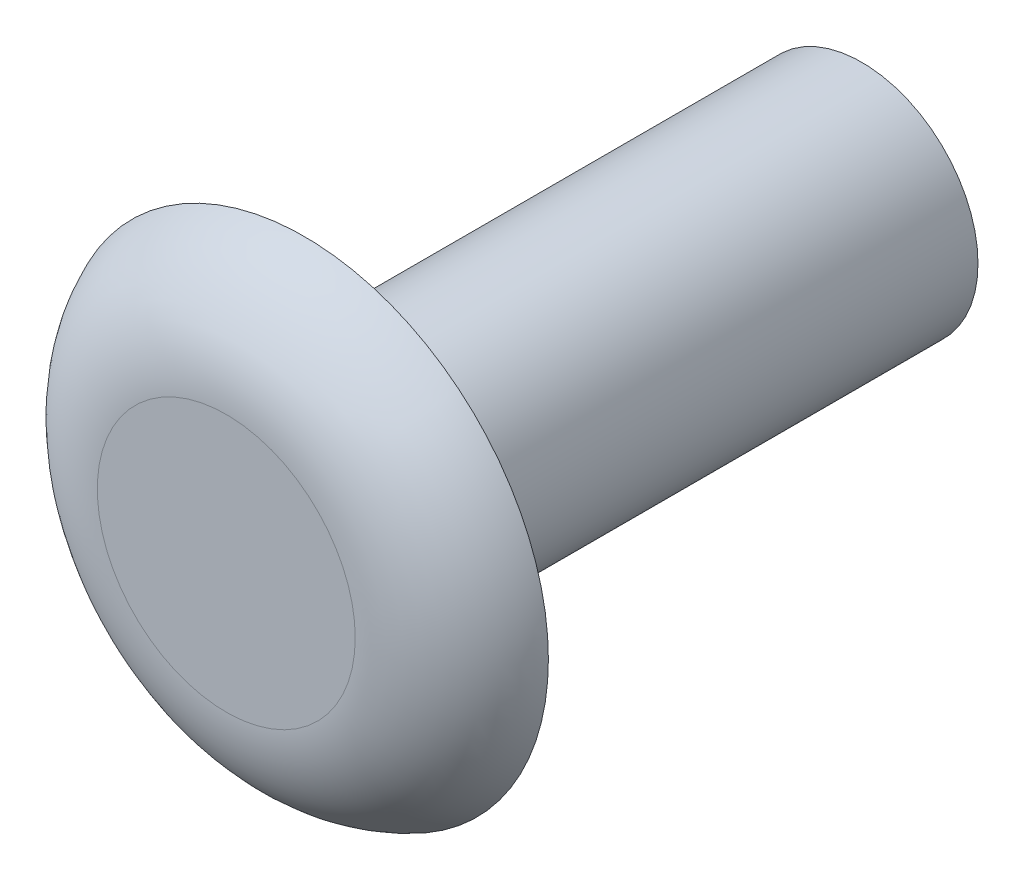
ISO-10303-21;
HEADER;
FILE_DESCRIPTION(('STEP AP214'),'2;1');
FILE_NAME('part.step','',(''),(''),'','','');
FILE_SCHEMA(('AUTOMOTIVE_DESIGN { 1 0 10303 214 1 1 1 1 }'));
ENDSEC;
DATA;
#1=APPLICATION_CONTEXT('core data for automotive mechanical design processes');
#2=APPLICATION_PROTOCOL_DEFINITION('international standard','automotive_design',2000,#1);
#3=PRODUCT_CONTEXT('',#1,'mechanical');
#4=PRODUCT('Part','Part','',(#3));
#5=PRODUCT_RELATED_PRODUCT_CATEGORY('part','',(#4));
#6=PRODUCT_DEFINITION_FORMATION('','',#4);
#7=PRODUCT_DEFINITION_CONTEXT('part definition',#1,'design');
#8=PRODUCT_DEFINITION('design','',#6,#7);
#9=PRODUCT_DEFINITION_SHAPE('','',#8);
#10=(LENGTH_UNIT() NAMED_UNIT(*) SI_UNIT(.MILLI.,.METRE.));
#11=(NAMED_UNIT(*) PLANE_ANGLE_UNIT() SI_UNIT($,.RADIAN.));
#12=(NAMED_UNIT(*) SI_UNIT($,.STERADIAN.) SOLID_ANGLE_UNIT());
#13=UNCERTAINTY_MEASURE_WITH_UNIT(LENGTH_MEASURE(1.E-05),#10,'distance_accuracy_value','');
#14=(GEOMETRIC_REPRESENTATION_CONTEXT(3) GLOBAL_UNCERTAINTY_ASSIGNED_CONTEXT((#13)) GLOBAL_UNIT_ASSIGNED_CONTEXT((#10,
#11,#12)) REPRESENTATION_CONTEXT('',''));
#15=CARTESIAN_POINT('',(0.,0.,0.));
#16=DIRECTION('',(0.,0.,1.));
#17=DIRECTION('',(1.,0.,0.));
#18=AXIS2_PLACEMENT_3D('',#15,#16,#17);
#19=CARTESIAN_POINT('',(0.,0.,1.6002));
#20=DIRECTION('',(0.,0.,1.));
#21=DIRECTION('',(1.,0.,0.));
#22=AXIS2_PLACEMENT_3D('',#19,#20,#21);
#23=PLANE('',#22);
#24=CARTESIAN_POINT('',(0.,0.,1.6002));
#25=DIRECTION('',(0.,0.,1.));
#26=DIRECTION('',(1.,0.,0.));
#27=AXIS2_PLACEMENT_3D('',#24,#25,#26);
#28=CIRCLE('',#27,2.64405934475841);
#29=CARTESIAN_POINT('',(2.64405934475841,0.,1.6002));
#30=VERTEX_POINT('',#29);
#31=EDGE_CURVE('E10',#30,#30,#28,.T.);
#32=ORIENTED_EDGE('',*,*,#31,.T.);
#33=EDGE_LOOP('',(#32));
#34=FACE_BOUND('',#33,.T.);
#35=ADVANCED_FACE('F34',(#34),#23,.T.);
#36=CARTESIAN_POINT('',(0.,0.,0.));
#37=DIRECTION('',(0.,0.,1.));
#38=DIRECTION('',(1.,0.,0.));
#39=AXIS2_PLACEMENT_3D('',#36,#37,#38);
#40=PLANE('',#39);
#41=CARTESIAN_POINT('',(0.,0.,0.));
#42=DIRECTION('',(0.,0.,1.));
#43=DIRECTION('',(1.,0.,0.));
#44=AXIS2_PLACEMENT_3D('',#41,#42,#43);
#45=CIRCLE('',#44,2.38125);
#46=CARTESIAN_POINT('',(2.38125,0.,0.));
#47=VERTEX_POINT('',#46);
#48=EDGE_CURVE('E49',#47,#47,#45,.T.);
#49=ORIENTED_EDGE('',*,*,#48,.T.);
#50=EDGE_LOOP('',(#49));
#51=FACE_BOUND('',#50,.T.);
#52=CARTESIAN_POINT('',(0.,0.,0.));
#53=DIRECTION('',(0.,0.,1.));
#54=DIRECTION('',(1.,0.,0.));
#55=AXIS2_PLACEMENT_3D('',#52,#53,#54);
#56=CIRCLE('',#55,5.0038);
#57=CARTESIAN_POINT('',(5.0038,0.,0.));
#58=VERTEX_POINT('',#57);
#59=EDGE_CURVE('E41',#58,#58,#56,.T.);
#60=ORIENTED_EDGE('',*,*,#59,.F.);
#61=EDGE_LOOP('',(#60));
#62=FACE_BOUND('',#61,.T.);
#63=ADVANCED_FACE('F55',(#51,#62),#40,.F.);
#64=CARTESIAN_POINT('',(0.,0.,-11.43));
#65=DIRECTION('',(0.,0.,1.));
#66=DIRECTION('',(1.,0.,0.));
#67=AXIS2_PLACEMENT_3D('',#64,#65,#66);
#68=CYLINDRICAL_SURFACE('',#67,2.38125);
#69=CARTESIAN_POINT('',(0.,0.,-11.43));
#70=DIRECTION('',(0.,0.,1.));
#71=DIRECTION('',(1.,0.,0.));
#72=AXIS2_PLACEMENT_3D('',#69,#70,#71);
#73=CIRCLE('',#72,2.38125);
#74=CARTESIAN_POINT('',(2.38125,0.,-11.43));
#75=VERTEX_POINT('',#74);
#76=EDGE_CURVE('E45',#75,#75,#73,.T.);
#77=ORIENTED_EDGE('',*,*,#76,.T.);
#78=EDGE_LOOP('',(#77));
#79=FACE_BOUND('',#78,.T.);
#80=ORIENTED_EDGE('',*,*,#48,.F.);
#81=EDGE_LOOP('',(#80));
#82=FACE_BOUND('',#81,.T.);
#83=ADVANCED_FACE('F58',(#79,#82),#68,.T.);
#84=CARTESIAN_POINT('',(0.,0.,-11.43));
#85=DIRECTION('',(0.,0.,1.));
#86=DIRECTION('',(1.,0.,0.));
#87=AXIS2_PLACEMENT_3D('',#84,#85,#86);
#88=PLANE('',#87);
#89=ORIENTED_EDGE('',*,*,#76,.F.);
#90=EDGE_LOOP('',(#89));
#91=FACE_BOUND('',#90,.T.);
#92=ADVANCED_FACE('F60',(#91),#88,.F.);
#93=CARTESIAN_POINT('',(0.,0.,-0.9398));
#94=DIRECTION('',(0.,0.,-1.));
#95=DIRECTION('',(-1.,0.,0.));
#96=AXIS2_PLACEMENT_3D('',#93,#94,#95);
#97=TOROIDAL_SURFACE('',#96,2.64405934475841,2.54);
#98=ORIENTED_EDGE('',*,*,#59,.T.);
#99=EDGE_LOOP('',(#98));
#100=FACE_BOUND('',#99,.T.);
#101=ORIENTED_EDGE('',*,*,#31,.F.);
#102=EDGE_LOOP('',(#101));
#103=FACE_BOUND('',#102,.T.);
#104=ADVANCED_FACE('F36',(#100,#103),#97,.T.);
#105=CLOSED_SHELL('',(#35,#63,#83,#92,#104));
#106=MANIFOLD_SOLID_BREP('B2',#105);
#107=ADVANCED_BREP_SHAPE_REPRESENTATION('',(#18,#106),#14);
#108=SHAPE_DEFINITION_REPRESENTATION(#9,#107);
ENDSEC;
END-ISO-10303-21;
